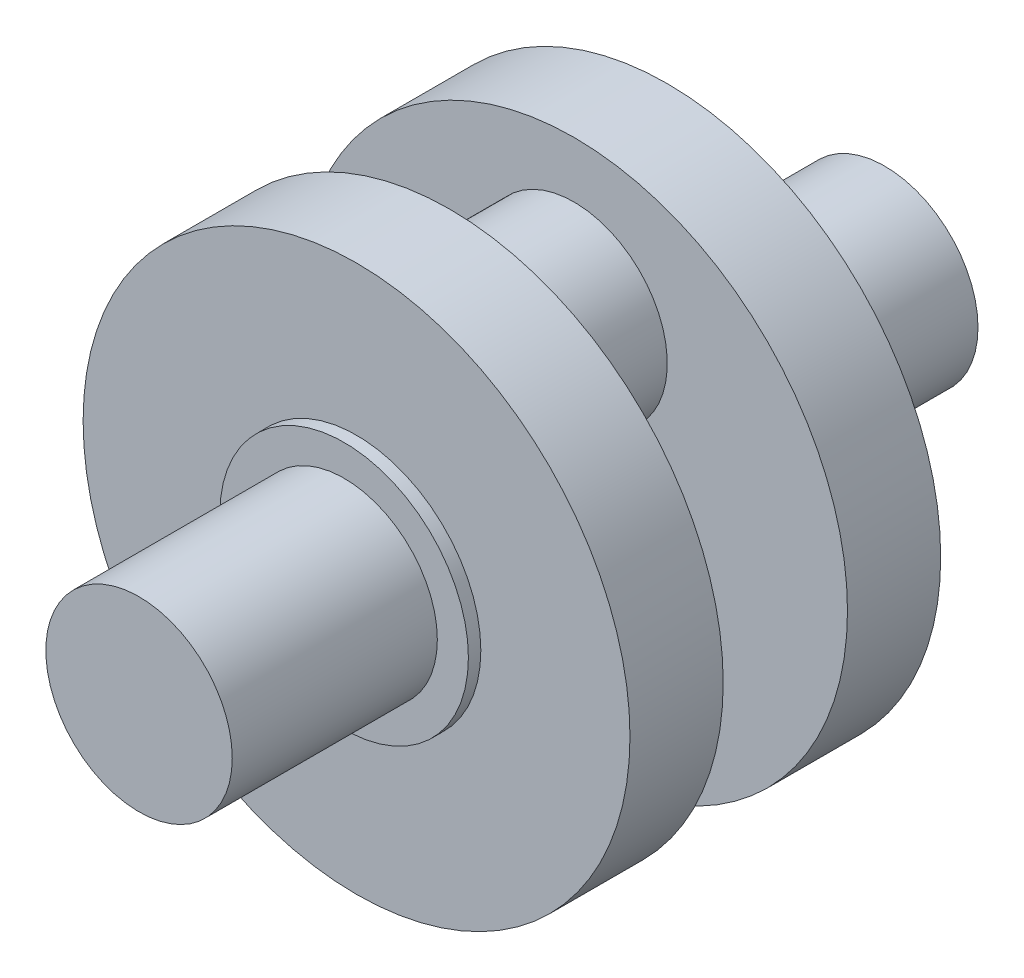
ISO-10303-21;
HEADER;
FILE_DESCRIPTION(('STEP AP214'),'2;1');
FILE_NAME('part.step','',(''),(''),'','','');
FILE_SCHEMA(('AUTOMOTIVE_DESIGN { 1 0 10303 214 1 1 1 1 }'));
ENDSEC;
DATA;
#1=APPLICATION_CONTEXT('core data for automotive mechanical design processes');
#2=APPLICATION_PROTOCOL_DEFINITION('international standard','automotive_design',2000,#1);
#3=PRODUCT_CONTEXT('',#1,'mechanical');
#4=PRODUCT('Part','Part','',(#3));
#5=PRODUCT_RELATED_PRODUCT_CATEGORY('part','',(#4));
#6=PRODUCT_DEFINITION_FORMATION('','',#4);
#7=PRODUCT_DEFINITION_CONTEXT('part definition',#1,'design');
#8=PRODUCT_DEFINITION('design','',#6,#7);
#9=PRODUCT_DEFINITION_SHAPE('','',#8);
#10=(LENGTH_UNIT() NAMED_UNIT(*) SI_UNIT(.MILLI.,.METRE.));
#11=(NAMED_UNIT(*) PLANE_ANGLE_UNIT() SI_UNIT($,.RADIAN.));
#12=(NAMED_UNIT(*) SI_UNIT($,.STERADIAN.) SOLID_ANGLE_UNIT());
#13=UNCERTAINTY_MEASURE_WITH_UNIT(LENGTH_MEASURE(1.E-05),#10,'distance_accuracy_value','');
#14=(GEOMETRIC_REPRESENTATION_CONTEXT(3) GLOBAL_UNCERTAINTY_ASSIGNED_CONTEXT((#13)) GLOBAL_UNIT_ASSIGNED_CONTEXT((#10,
#11,#12)) REPRESENTATION_CONTEXT('',''));
#15=CARTESIAN_POINT('',(0.,0.,0.));
#16=DIRECTION('',(0.,0.,1.));
#17=DIRECTION('',(1.,0.,0.));
#18=AXIS2_PLACEMENT_3D('',#15,#16,#17);
#19=CARTESIAN_POINT('',(0.,0.,33.));
#20=DIRECTION('',(0.,0.,-1.));
#21=DIRECTION('',(-1.,0.,0.));
#22=AXIS2_PLACEMENT_3D('',#19,#20,#21);
#23=CYLINDRICAL_SURFACE('',#22,15.);
#24=CARTESIAN_POINT('',(0.,0.,33.));
#25=DIRECTION('',(0.,0.,1.));
#26=DIRECTION('',(1.,0.,0.));
#27=AXIS2_PLACEMENT_3D('',#24,#25,#26);
#28=CIRCLE('',#27,15.);
#29=CARTESIAN_POINT('',(15.,0.,33.));
#30=VERTEX_POINT('',#29);
#31=EDGE_CURVE('E10',#30,#30,#28,.T.);
#32=ORIENTED_EDGE('',*,*,#31,.F.);
#33=EDGE_LOOP('',(#32));
#34=FACE_BOUND('',#33,.T.);
#35=CARTESIAN_POINT('',(0.,0.,0.));
#36=DIRECTION('',(0.,0.,1.));
#37=DIRECTION('',(1.,0.,0.));
#38=AXIS2_PLACEMENT_3D('',#35,#36,#37);
#39=CIRCLE('',#38,15.);
#40=CARTESIAN_POINT('',(15.,0.,0.));
#41=VERTEX_POINT('',#40);
#42=EDGE_CURVE('E34',#41,#41,#39,.T.);
#43=ORIENTED_EDGE('',*,*,#42,.T.);
#44=EDGE_LOOP('',(#43));
#45=FACE_BOUND('',#44,.T.);
#46=ADVANCED_FACE('F31',(#34,#45),#23,.T.);
#47=CARTESIAN_POINT('',(0.,0.,33.));
#48=DIRECTION('',(0.,0.,1.));
#49=DIRECTION('',(1.,0.,0.));
#50=AXIS2_PLACEMENT_3D('',#47,#48,#49);
#51=PLANE('',#50);
#52=ORIENTED_EDGE('',*,*,#31,.T.);
#53=EDGE_LOOP('',(#52));
#54=FACE_BOUND('',#53,.T.);
#55=ADVANCED_FACE('F100',(#54),#51,.T.);
#56=CARTESIAN_POINT('',(0.,0.,-2.));
#57=DIRECTION('',(0.,0.,1.));
#58=DIRECTION('',(1.,0.,0.));
#59=AXIS2_PLACEMENT_3D('',#56,#57,#58);
#60=CYLINDRICAL_SURFACE('',#59,20.);
#61=CARTESIAN_POINT('',(0.,0.,-2.));
#62=DIRECTION('',(0.,0.,-1.));
#63=DIRECTION('',(-1.,0.,0.));
#64=AXIS2_PLACEMENT_3D('',#61,#62,#63);
#65=CIRCLE('',#64,20.);
#66=CARTESIAN_POINT('',(-20.,0.,-2.));
#67=VERTEX_POINT('',#66);
#68=EDGE_CURVE('E41',#67,#67,#65,.T.);
#69=ORIENTED_EDGE('',*,*,#68,.F.);
#70=EDGE_LOOP('',(#69));
#71=FACE_BOUND('',#70,.T.);
#72=CARTESIAN_POINT('',(0.,0.,0.));
#73=DIRECTION('',(0.,0.,-1.));
#74=DIRECTION('',(-1.,0.,0.));
#75=AXIS2_PLACEMENT_3D('',#72,#73,#74);
#76=CIRCLE('',#75,20.);
#77=CARTESIAN_POINT('',(-20.,0.,0.));
#78=VERTEX_POINT('',#77);
#79=EDGE_CURVE('E43',#78,#78,#76,.T.);
#80=ORIENTED_EDGE('',*,*,#79,.T.);
#81=EDGE_LOOP('',(#80));
#82=FACE_BOUND('',#81,.T.);
#83=ADVANCED_FACE('F105',(#71,#82),#60,.T.);
#84=CARTESIAN_POINT('',(0.,0.,0.));
#85=DIRECTION('',(0.,0.,-1.));
#86=DIRECTION('',(-1.,0.,0.));
#87=AXIS2_PLACEMENT_3D('',#84,#85,#86);
#88=PLANE('',#87);
#89=ORIENTED_EDGE('',*,*,#42,.F.);
#90=EDGE_LOOP('',(#89));
#91=FACE_BOUND('',#90,.T.);
#92=ORIENTED_EDGE('',*,*,#79,.F.);
#93=EDGE_LOOP('',(#92));
#94=FACE_BOUND('',#93,.T.);
#95=ADVANCED_FACE('F109',(#91,#94),#88,.F.);
#96=CARTESIAN_POINT('',(0.,0.,-17.));
#97=DIRECTION('',(0.,0.,1.));
#98=DIRECTION('',(1.,0.,0.));
#99=AXIS2_PLACEMENT_3D('',#96,#97,#98);
#100=CYLINDRICAL_SURFACE('',#99,44.);
#101=CARTESIAN_POINT('',(0.,0.,-17.));
#102=DIRECTION('',(0.,0.,-1.));
#103=DIRECTION('',(-1.,0.,0.));
#104=AXIS2_PLACEMENT_3D('',#101,#102,#103);
#105=CIRCLE('',#104,44.);
#106=CARTESIAN_POINT('',(-44.,0.,-17.));
#107=VERTEX_POINT('',#106);
#108=EDGE_CURVE('E46',#107,#107,#105,.T.);
#109=ORIENTED_EDGE('',*,*,#108,.F.);
#110=EDGE_LOOP('',(#109));
#111=FACE_BOUND('',#110,.T.);
#112=CARTESIAN_POINT('',(0.,0.,-2.));
#113=DIRECTION('',(0.,0.,-1.));
#114=DIRECTION('',(-1.,0.,0.));
#115=AXIS2_PLACEMENT_3D('',#112,#113,#114);
#116=CIRCLE('',#115,44.);
#117=CARTESIAN_POINT('',(-44.,0.,-2.));
#118=VERTEX_POINT('',#117);
#119=EDGE_CURVE('E49',#118,#118,#116,.T.);
#120=ORIENTED_EDGE('',*,*,#119,.T.);
#121=EDGE_LOOP('',(#120));
#122=FACE_BOUND('',#121,.T.);
#123=ADVANCED_FACE('F112',(#111,#122),#100,.T.);
#124=CARTESIAN_POINT('',(0.,0.,-17.));
#125=DIRECTION('',(0.,0.,-1.));
#126=DIRECTION('',(-1.,0.,0.));
#127=AXIS2_PLACEMENT_3D('',#124,#125,#126);
#128=PLANE('',#127);
#129=CARTESIAN_POINT('',(0.,20.,-17.));
#130=DIRECTION('',(0.,0.,-1.));
#131=DIRECTION('',(-1.,0.,0.));
#132=AXIS2_PLACEMENT_3D('',#129,#130,#131);
#133=CIRCLE('',#132,15.);
#134=CARTESIAN_POINT('',(-15.,20.,-17.));
#135=VERTEX_POINT('',#134);
#136=EDGE_CURVE('E52',#135,#135,#133,.T.);
#137=ORIENTED_EDGE('',*,*,#136,.F.);
#138=EDGE_LOOP('',(#137));
#139=FACE_BOUND('',#138,.T.);
#140=ORIENTED_EDGE('',*,*,#108,.T.);
#141=EDGE_LOOP('',(#140));
#142=FACE_BOUND('',#141,.T.);
#143=ADVANCED_FACE('F95',(#139,#142),#128,.T.);
#144=CARTESIAN_POINT('',(0.,0.,-2.));
#145=DIRECTION('',(0.,0.,-1.));
#146=DIRECTION('',(-1.,0.,0.));
#147=AXIS2_PLACEMENT_3D('',#144,#145,#146);
#148=PLANE('',#147);
#149=ORIENTED_EDGE('',*,*,#68,.T.);
#150=EDGE_LOOP('',(#149));
#151=FACE_BOUND('',#150,.T.);
#152=ORIENTED_EDGE('',*,*,#119,.F.);
#153=EDGE_LOOP('',(#152));
#154=FACE_BOUND('',#153,.T.);
#155=ADVANCED_FACE('F85',(#151,#154),#148,.F.);
#156=CARTESIAN_POINT('',(0.,20.,-27.));
#157=DIRECTION('',(0.,0.,1.));
#158=DIRECTION('',(1.,0.,0.));
#159=AXIS2_PLACEMENT_3D('',#156,#157,#158);
#160=CYLINDRICAL_SURFACE('',#159,15.);
#161=ORIENTED_EDGE('',*,*,#136,.T.);
#162=EDGE_LOOP('',(#161));
#163=FACE_BOUND('',#162,.T.);
#164=CARTESIAN_POINT('',(0.,20.,-37.));
#165=DIRECTION('',(0.,0.,-1.));
#166=DIRECTION('',(-1.,0.,0.));
#167=AXIS2_PLACEMENT_3D('',#164,#165,#166);
#168=CIRCLE('',#167,15.);
#169=CARTESIAN_POINT('',(-15.,20.,-37.));
#170=VERTEX_POINT('',#169);
#171=EDGE_CURVE('E73',#170,#170,#168,.T.);
#172=ORIENTED_EDGE('',*,*,#171,.F.);
#173=EDGE_LOOP('',(#172));
#174=FACE_BOUND('',#173,.T.);
#175=ADVANCED_FACE('F82',(#163,#174),#160,.T.);
#176=CARTESIAN_POINT('',(0.,0.,-87.));
#177=DIRECTION('',(0.,0.,1.));
#178=DIRECTION('',(-1.,0.,0.));
#179=AXIS2_PLACEMENT_3D('',#176,#177,#178);
#180=CYLINDRICAL_SURFACE('',#179,15.);
#181=CARTESIAN_POINT('',(0.,0.,-87.));
#182=DIRECTION('',(0.,0.,1.));
#183=DIRECTION('',(1.,0.,0.));
#184=AXIS2_PLACEMENT_3D('',#181,#182,#183);
#185=CIRCLE('',#184,15.);
#186=CARTESIAN_POINT('',(15.,0.,-87.));
#187=VERTEX_POINT('',#186);
#188=EDGE_CURVE('E57',#187,#187,#185,.T.);
#189=ORIENTED_EDGE('',*,*,#188,.T.);
#190=EDGE_LOOP('',(#189));
#191=FACE_BOUND('',#190,.T.);
#192=CARTESIAN_POINT('',(0.,0.,-54.));
#193=DIRECTION('',(0.,0.,1.));
#194=DIRECTION('',(1.,0.,0.));
#195=AXIS2_PLACEMENT_3D('',#192,#193,#194);
#196=CIRCLE('',#195,15.);
#197=CARTESIAN_POINT('',(15.,0.,-54.));
#198=VERTEX_POINT('',#197);
#199=EDGE_CURVE('E58',#198,#198,#196,.T.);
#200=ORIENTED_EDGE('',*,*,#199,.F.);
#201=EDGE_LOOP('',(#200));
#202=FACE_BOUND('',#201,.T.);
#203=ADVANCED_FACE('F84',(#191,#202),#180,.T.);
#204=CARTESIAN_POINT('',(0.,0.,-87.));
#205=DIRECTION('',(0.,0.,-1.));
#206=DIRECTION('',(1.,0.,0.));
#207=AXIS2_PLACEMENT_3D('',#204,#205,#206);
#208=PLANE('',#207);
#209=ORIENTED_EDGE('',*,*,#188,.F.);
#210=EDGE_LOOP('',(#209));
#211=FACE_BOUND('',#210,.T.);
#212=ADVANCED_FACE('F92',(#211),#208,.T.);
#213=CARTESIAN_POINT('',(0.,0.,-52.));
#214=DIRECTION('',(0.,0.,-1.));
#215=DIRECTION('',(1.,0.,0.));
#216=AXIS2_PLACEMENT_3D('',#213,#214,#215);
#217=CYLINDRICAL_SURFACE('',#216,20.);
#218=CARTESIAN_POINT('',(0.,0.,-52.));
#219=DIRECTION('',(0.,0.,-1.));
#220=DIRECTION('',(-1.,0.,0.));
#221=AXIS2_PLACEMENT_3D('',#218,#219,#220);
#222=CIRCLE('',#221,20.);
#223=CARTESIAN_POINT('',(-20.,0.,-52.));
#224=VERTEX_POINT('',#223);
#225=EDGE_CURVE('E61',#224,#224,#222,.T.);
#226=ORIENTED_EDGE('',*,*,#225,.T.);
#227=EDGE_LOOP('',(#226));
#228=FACE_BOUND('',#227,.T.);
#229=CARTESIAN_POINT('',(0.,0.,-54.));
#230=DIRECTION('',(0.,0.,-1.));
#231=DIRECTION('',(-1.,0.,0.));
#232=AXIS2_PLACEMENT_3D('',#229,#230,#231);
#233=CIRCLE('',#232,20.);
#234=CARTESIAN_POINT('',(-20.,0.,-54.));
#235=VERTEX_POINT('',#234);
#236=EDGE_CURVE('E64',#235,#235,#233,.T.);
#237=ORIENTED_EDGE('',*,*,#236,.F.);
#238=EDGE_LOOP('',(#237));
#239=FACE_BOUND('',#238,.T.);
#240=ADVANCED_FACE('F187',(#228,#239),#217,.T.);
#241=CARTESIAN_POINT('',(0.,0.,-54.));
#242=DIRECTION('',(0.,0.,1.));
#243=DIRECTION('',(-1.,0.,0.));
#244=AXIS2_PLACEMENT_3D('',#241,#242,#243);
#245=PLANE('',#244);
#246=ORIENTED_EDGE('',*,*,#199,.T.);
#247=EDGE_LOOP('',(#246));
#248=FACE_BOUND('',#247,.T.);
#249=ORIENTED_EDGE('',*,*,#236,.T.);
#250=EDGE_LOOP('',(#249));
#251=FACE_BOUND('',#250,.T.);
#252=ADVANCED_FACE('F196',(#248,#251),#245,.F.);
#253=CARTESIAN_POINT('',(0.,0.,-37.));
#254=DIRECTION('',(0.,0.,-1.));
#255=DIRECTION('',(1.,0.,0.));
#256=AXIS2_PLACEMENT_3D('',#253,#254,#255);
#257=CYLINDRICAL_SURFACE('',#256,44.);
#258=CARTESIAN_POINT('',(0.,0.,-37.));
#259=DIRECTION('',(0.,0.,-1.));
#260=DIRECTION('',(-1.,0.,0.));
#261=AXIS2_PLACEMENT_3D('',#258,#259,#260);
#262=CIRCLE('',#261,44.);
#263=CARTESIAN_POINT('',(-44.,0.,-37.));
#264=VERTEX_POINT('',#263);
#265=EDGE_CURVE('E67',#264,#264,#262,.T.);
#266=ORIENTED_EDGE('',*,*,#265,.T.);
#267=EDGE_LOOP('',(#266));
#268=FACE_BOUND('',#267,.T.);
#269=CARTESIAN_POINT('',(0.,0.,-52.));
#270=DIRECTION('',(0.,0.,-1.));
#271=DIRECTION('',(-1.,0.,0.));
#272=AXIS2_PLACEMENT_3D('',#269,#270,#271);
#273=CIRCLE('',#272,44.);
#274=CARTESIAN_POINT('',(-44.,0.,-52.));
#275=VERTEX_POINT('',#274);
#276=EDGE_CURVE('E70',#275,#275,#273,.T.);
#277=ORIENTED_EDGE('',*,*,#276,.F.);
#278=EDGE_LOOP('',(#277));
#279=FACE_BOUND('',#278,.T.);
#280=ADVANCED_FACE('F205',(#268,#279),#257,.T.);
#281=CARTESIAN_POINT('',(0.,0.,-37.));
#282=DIRECTION('',(0.,0.,1.));
#283=DIRECTION('',(-1.,0.,0.));
#284=AXIS2_PLACEMENT_3D('',#281,#282,#283);
#285=PLANE('',#284);
#286=ORIENTED_EDGE('',*,*,#171,.T.);
#287=EDGE_LOOP('',(#286));
#288=FACE_BOUND('',#287,.T.);
#289=ORIENTED_EDGE('',*,*,#265,.F.);
#290=EDGE_LOOP('',(#289));
#291=FACE_BOUND('',#290,.T.);
#292=ADVANCED_FACE('F79',(#288,#291),#285,.T.);
#293=CARTESIAN_POINT('',(0.,0.,-52.));
#294=DIRECTION('',(0.,0.,1.));
#295=DIRECTION('',(-1.,0.,0.));
#296=AXIS2_PLACEMENT_3D('',#293,#294,#295);
#297=PLANE('',#296);
#298=ORIENTED_EDGE('',*,*,#225,.F.);
#299=EDGE_LOOP('',(#298));
#300=FACE_BOUND('',#299,.T.);
#301=ORIENTED_EDGE('',*,*,#276,.T.);
#302=EDGE_LOOP('',(#301));
#303=FACE_BOUND('',#302,.T.);
#304=ADVANCED_FACE('F222',(#300,#303),#297,.F.);
#305=CLOSED_SHELL('',(#46,#55,#83,#95,#123,#143,#155,#175,#203,#212,#240,#252,#280,#292,#304));
#306=MANIFOLD_SOLID_BREP('B2',#305);
#307=ADVANCED_BREP_SHAPE_REPRESENTATION('',(#18,#306),#14);
#308=SHAPE_DEFINITION_REPRESENTATION(#9,#307);
ENDSEC;
END-ISO-10303-21;
